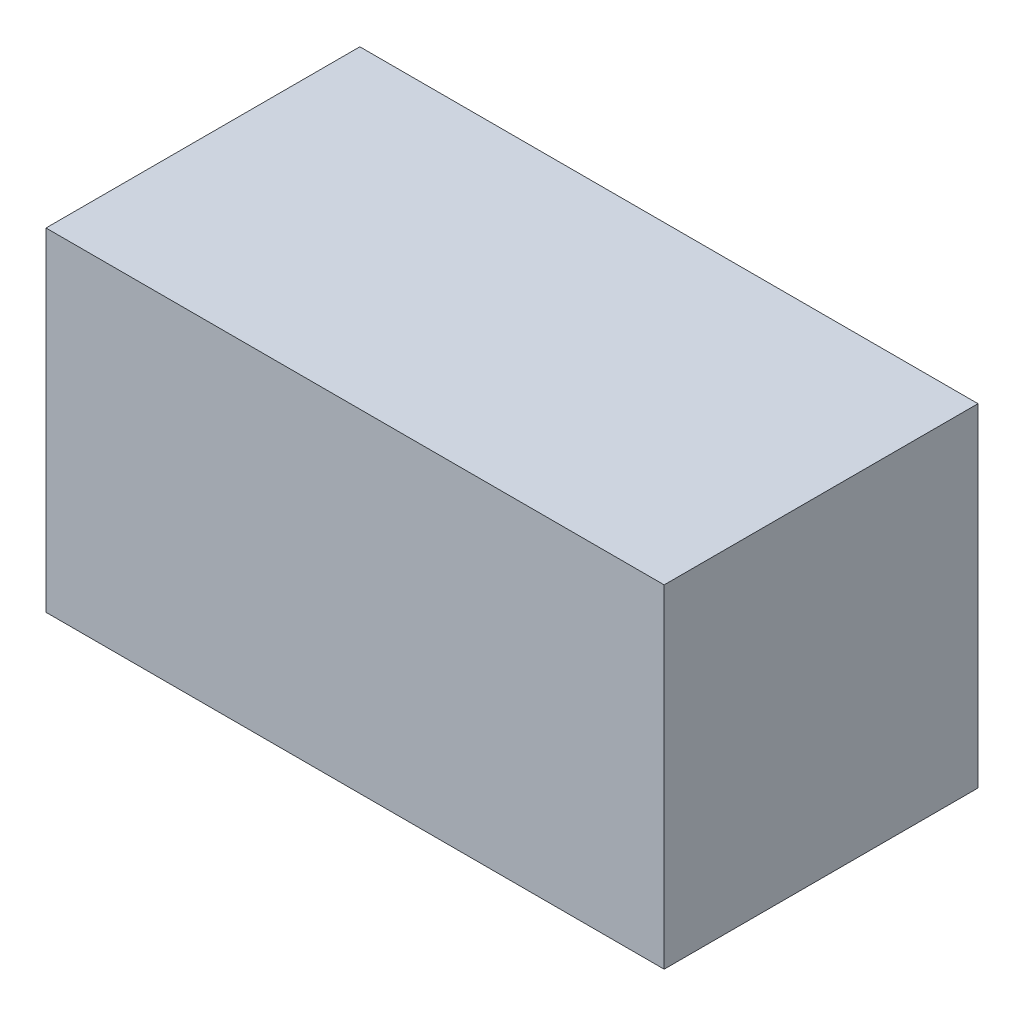
ISO-10303-21;
HEADER;
FILE_DESCRIPTION(('STEP AP214'),'2;1');
FILE_NAME('part.step','',(''),(''),'','','');
FILE_SCHEMA(('AUTOMOTIVE_DESIGN { 1 0 10303 214 1 1 1 1 }'));
ENDSEC;
DATA;
#1=APPLICATION_CONTEXT('core data for automotive mechanical design processes');
#2=APPLICATION_PROTOCOL_DEFINITION('international standard','automotive_design',2000,#1);
#3=PRODUCT_CONTEXT('',#1,'mechanical');
#4=PRODUCT('Part','Part','',(#3));
#5=PRODUCT_RELATED_PRODUCT_CATEGORY('part','',(#4));
#6=PRODUCT_DEFINITION_FORMATION('','',#4);
#7=PRODUCT_DEFINITION_CONTEXT('part definition',#1,'design');
#8=PRODUCT_DEFINITION('design','',#6,#7);
#9=PRODUCT_DEFINITION_SHAPE('','',#8);
#10=(LENGTH_UNIT() NAMED_UNIT(*) SI_UNIT(.MILLI.,.METRE.));
#11=(NAMED_UNIT(*) PLANE_ANGLE_UNIT() SI_UNIT($,.RADIAN.));
#12=(NAMED_UNIT(*) SI_UNIT($,.STERADIAN.) SOLID_ANGLE_UNIT());
#13=UNCERTAINTY_MEASURE_WITH_UNIT(LENGTH_MEASURE(1.E-05),#10,'distance_accuracy_value','');
#14=(GEOMETRIC_REPRESENTATION_CONTEXT(3) GLOBAL_UNCERTAINTY_ASSIGNED_CONTEXT((#13)) GLOBAL_UNIT_ASSIGNED_CONTEXT((#10,
#11,#12)) REPRESENTATION_CONTEXT('',''));
#15=CARTESIAN_POINT('',(0.,0.,0.));
#16=DIRECTION('',(0.,0.,1.));
#17=DIRECTION('',(1.,0.,0.));
#18=AXIS2_PLACEMENT_3D('',#15,#16,#17);
#19=CARTESIAN_POINT('',(0.32500062,0.17500092,0.32999934));
#20=DIRECTION('',(0.,0.,1.));
#21=DIRECTION('',(1.,0.,0.));
#22=AXIS2_PLACEMENT_3D('',#19,#20,#21);
#23=PLANE('',#22);
#24=DIRECTION('',(1.,0.,0.));
#25=VECTOR('',#24,1.);
#26=CARTESIAN_POINT('',(-0.32500062,0.17500092,0.32999934));
#27=LINE('',#26,#25);
#28=CARTESIAN_POINT('',(-0.32500062,0.17500092,0.32999934));
#29=VERTEX_POINT('',#28);
#30=CARTESIAN_POINT('',(0.32500062,0.17500092,0.32999934));
#31=VERTEX_POINT('',#30);
#32=EDGE_CURVE('E26',#29,#31,#27,.T.);
#33=ORIENTED_EDGE('',*,*,#32,.F.);
#34=DIRECTION('',(0.,1.,0.));
#35=VECTOR('',#34,1.);
#36=CARTESIAN_POINT('',(-0.32500062,-0.17500092,0.32999934));
#37=LINE('',#36,#35);
#38=CARTESIAN_POINT('',(-0.32500062,-0.17500092,0.32999934));
#39=VERTEX_POINT('',#38);
#40=EDGE_CURVE('E85',#39,#29,#37,.T.);
#41=ORIENTED_EDGE('',*,*,#40,.F.);
#42=DIRECTION('',(-1.,0.,0.));
#43=VECTOR('',#42,1.);
#44=CARTESIAN_POINT('',(0.32500062,-0.17500092,0.32999934));
#45=LINE('',#44,#43);
#46=CARTESIAN_POINT('',(0.32500062,-0.17500092,0.32999934));
#47=VERTEX_POINT('',#46);
#48=EDGE_CURVE('E88',#47,#39,#45,.T.);
#49=ORIENTED_EDGE('',*,*,#48,.F.);
#50=DIRECTION('',(0.,-1.,0.));
#51=VECTOR('',#50,1.);
#52=CARTESIAN_POINT('',(0.32500062,0.17500092,0.32999934));
#53=LINE('',#52,#51);
#54=EDGE_CURVE('E99',#31,#47,#53,.T.);
#55=ORIENTED_EDGE('',*,*,#54,.F.);
#56=EDGE_LOOP('',(#33,#41,#49,#55));
#57=FACE_BOUND('',#56,.T.);
#58=ADVANCED_FACE('F17',(#57),#23,.T.);
#59=CARTESIAN_POINT('',(0.32500062,0.17500092,0.));
#60=DIRECTION('',(0.,0.,1.));
#61=DIRECTION('',(1.,0.,0.));
#62=AXIS2_PLACEMENT_3D('',#59,#60,#61);
#63=PLANE('',#62);
#64=DIRECTION('',(0.,-1.,0.));
#65=VECTOR('',#64,1.);
#66=CARTESIAN_POINT('',(0.32500062,0.17500092,0.));
#67=LINE('',#66,#65);
#68=CARTESIAN_POINT('',(0.32500062,0.17500092,0.));
#69=VERTEX_POINT('',#68);
#70=CARTESIAN_POINT('',(0.32500062,-0.17500092,0.));
#71=VERTEX_POINT('',#70);
#72=EDGE_CURVE('E80',#69,#71,#67,.T.);
#73=ORIENTED_EDGE('',*,*,#72,.T.);
#74=DIRECTION('',(-1.,0.,0.));
#75=VECTOR('',#74,1.);
#76=CARTESIAN_POINT('',(0.32500062,-0.17500092,0.));
#77=LINE('',#76,#75);
#78=CARTESIAN_POINT('',(-0.32500062,-0.17500092,0.));
#79=VERTEX_POINT('',#78);
#80=EDGE_CURVE('E77',#71,#79,#77,.T.);
#81=ORIENTED_EDGE('',*,*,#80,.T.);
#82=DIRECTION('',(0.,1.,0.));
#83=VECTOR('',#82,1.);
#84=CARTESIAN_POINT('',(-0.32500062,-0.17500092,0.));
#85=LINE('',#84,#83);
#86=CARTESIAN_POINT('',(-0.32500062,0.17500092,0.));
#87=VERTEX_POINT('',#86);
#88=EDGE_CURVE('E65',#79,#87,#85,.T.);
#89=ORIENTED_EDGE('',*,*,#88,.T.);
#90=DIRECTION('',(1.,0.,0.));
#91=VECTOR('',#90,1.);
#92=CARTESIAN_POINT('',(-0.32500062,0.17500092,0.));
#93=LINE('',#92,#91);
#94=EDGE_CURVE('E11',#87,#69,#93,.T.);
#95=ORIENTED_EDGE('',*,*,#94,.T.);
#96=EDGE_LOOP('',(#73,#81,#89,#95));
#97=FACE_BOUND('',#96,.T.);
#98=ADVANCED_FACE('F78',(#97),#63,.F.);
#99=CARTESIAN_POINT('',(-0.32500062,0.17500092,0.));
#100=DIRECTION('',(0.,1.,0.));
#101=DIRECTION('',(1.,0.,0.));
#102=AXIS2_PLACEMENT_3D('',#99,#100,#101);
#103=PLANE('',#102);
#104=DIRECTION('',(0.,0.,1.));
#105=VECTOR('',#104,1.);
#106=CARTESIAN_POINT('',(-0.32500062,0.17500092,0.));
#107=LINE('',#106,#105);
#108=EDGE_CURVE('E72',#87,#29,#107,.T.);
#109=ORIENTED_EDGE('',*,*,#108,.T.);
#110=ORIENTED_EDGE('',*,*,#32,.T.);
#111=DIRECTION('',(0.,0.,1.));
#112=VECTOR('',#111,1.);
#113=CARTESIAN_POINT('',(0.32500062,0.17500092,0.));
#114=LINE('',#113,#112);
#115=EDGE_CURVE('E98',#69,#31,#114,.T.);
#116=ORIENTED_EDGE('',*,*,#115,.F.);
#117=ORIENTED_EDGE('',*,*,#94,.F.);
#118=EDGE_LOOP('',(#109,#110,#116,#117));
#119=FACE_BOUND('',#118,.T.);
#120=ADVANCED_FACE('F115',(#119),#103,.T.);
#121=CARTESIAN_POINT('',(-0.32500062,-0.17500092,0.));
#122=DIRECTION('',(-1.,0.,0.));
#123=DIRECTION('',(0.,0.,1.));
#124=AXIS2_PLACEMENT_3D('',#121,#122,#123);
#125=PLANE('',#124);
#126=DIRECTION('',(0.,0.,1.));
#127=VECTOR('',#126,1.);
#128=CARTESIAN_POINT('',(-0.32500062,-0.17500092,0.));
#129=LINE('',#128,#127);
#130=EDGE_CURVE('E70',#79,#39,#129,.T.);
#131=ORIENTED_EDGE('',*,*,#130,.T.);
#132=ORIENTED_EDGE('',*,*,#40,.T.);
#133=ORIENTED_EDGE('',*,*,#108,.F.);
#134=ORIENTED_EDGE('',*,*,#88,.F.);
#135=EDGE_LOOP('',(#131,#132,#133,#134));
#136=FACE_BOUND('',#135,.T.);
#137=ADVANCED_FACE('F67',(#136),#125,.T.);
#138=CARTESIAN_POINT('',(0.32500062,-0.17500092,0.));
#139=DIRECTION('',(0.,-1.,0.));
#140=DIRECTION('',(0.,0.,-1.));
#141=AXIS2_PLACEMENT_3D('',#138,#139,#140);
#142=PLANE('',#141);
#143=DIRECTION('',(0.,0.,1.));
#144=VECTOR('',#143,1.);
#145=CARTESIAN_POINT('',(0.32500062,-0.17500092,0.));
#146=LINE('',#145,#144);
#147=EDGE_CURVE('E102',#71,#47,#146,.T.);
#148=ORIENTED_EDGE('',*,*,#147,.T.);
#149=ORIENTED_EDGE('',*,*,#48,.T.);
#150=ORIENTED_EDGE('',*,*,#130,.F.);
#151=ORIENTED_EDGE('',*,*,#80,.F.);
#152=EDGE_LOOP('',(#148,#149,#150,#151));
#153=FACE_BOUND('',#152,.T.);
#154=ADVANCED_FACE('F87',(#153),#142,.T.);
#155=CARTESIAN_POINT('',(0.32500062,0.17500092,0.));
#156=DIRECTION('',(1.,0.,0.));
#157=DIRECTION('',(0.,1.,0.));
#158=AXIS2_PLACEMENT_3D('',#155,#156,#157);
#159=PLANE('',#158);
#160=ORIENTED_EDGE('',*,*,#115,.T.);
#161=ORIENTED_EDGE('',*,*,#54,.T.);
#162=ORIENTED_EDGE('',*,*,#147,.F.);
#163=ORIENTED_EDGE('',*,*,#72,.F.);
#164=EDGE_LOOP('',(#160,#161,#162,#163));
#165=FACE_BOUND('',#164,.T.);
#166=ADVANCED_FACE('F119',(#165),#159,.T.);
#167=CLOSED_SHELL('',(#58,#98,#120,#137,#154,#166));
#168=MANIFOLD_SOLID_BREP('B1',#167);
#169=ADVANCED_BREP_SHAPE_REPRESENTATION('',(#18,#168),#14);
#170=SHAPE_DEFINITION_REPRESENTATION(#9,#169);
ENDSEC;
END-ISO-10303-21;
